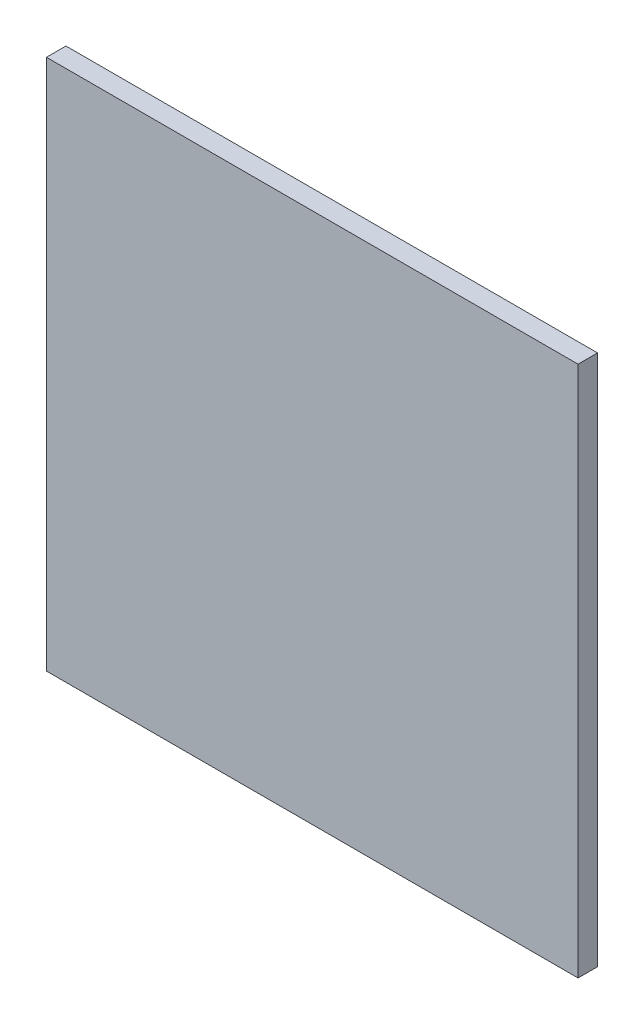
ISO-10303-21;
HEADER;
FILE_DESCRIPTION(('STEP AP214'),'2;1');
FILE_NAME('part.step','',(''),(''),'','','');
FILE_SCHEMA(('AUTOMOTIVE_DESIGN { 1 0 10303 214 1 1 1 1 }'));
ENDSEC;
DATA;
#1=APPLICATION_CONTEXT('core data for automotive mechanical design processes');
#2=APPLICATION_PROTOCOL_DEFINITION('international standard','automotive_design',2000,#1);
#3=PRODUCT_CONTEXT('',#1,'mechanical');
#4=PRODUCT('Part','Part','',(#3));
#5=PRODUCT_RELATED_PRODUCT_CATEGORY('part','',(#4));
#6=PRODUCT_DEFINITION_FORMATION('','',#4);
#7=PRODUCT_DEFINITION_CONTEXT('part definition',#1,'design');
#8=PRODUCT_DEFINITION('design','',#6,#7);
#9=PRODUCT_DEFINITION_SHAPE('','',#8);
#10=(LENGTH_UNIT() NAMED_UNIT(*) SI_UNIT(.MILLI.,.METRE.));
#11=(NAMED_UNIT(*) PLANE_ANGLE_UNIT() SI_UNIT($,.RADIAN.));
#12=(NAMED_UNIT(*) SI_UNIT($,.STERADIAN.) SOLID_ANGLE_UNIT());
#13=UNCERTAINTY_MEASURE_WITH_UNIT(LENGTH_MEASURE(1.E-05),#10,'distance_accuracy_value','');
#14=(GEOMETRIC_REPRESENTATION_CONTEXT(3) GLOBAL_UNCERTAINTY_ASSIGNED_CONTEXT((#13)) GLOBAL_UNIT_ASSIGNED_CONTEXT((#10,
#11,#12)) REPRESENTATION_CONTEXT('',''));
#15=CARTESIAN_POINT('',(0.,0.,0.));
#16=DIRECTION('',(0.,0.,1.));
#17=DIRECTION('',(1.,0.,0.));
#18=AXIS2_PLACEMENT_3D('',#15,#16,#17);
#19=CARTESIAN_POINT('',(15.,-15.,1.1));
#20=DIRECTION('',(-1.,0.,0.));
#21=DIRECTION('',(0.,0.,1.));
#22=AXIS2_PLACEMENT_3D('',#19,#20,#21);
#23=PLANE('',#22);
#24=DIRECTION('',(0.,1.,0.));
#25=VECTOR('',#24,1.);
#26=CARTESIAN_POINT('',(15.,-15.,0.));
#27=LINE('',#26,#25);
#28=CARTESIAN_POINT('',(15.,-15.,0.));
#29=VERTEX_POINT('',#28);
#30=CARTESIAN_POINT('',(15.,15.,0.));
#31=VERTEX_POINT('',#30);
#32=EDGE_CURVE('E108',#29,#31,#27,.T.);
#33=ORIENTED_EDGE('',*,*,#32,.T.);
#34=DIRECTION('',(0.,0.,-1.));
#35=VECTOR('',#34,1.);
#36=CARTESIAN_POINT('',(15.,15.,1.1));
#37=LINE('',#36,#35);
#38=CARTESIAN_POINT('',(15.,15.,1.1));
#39=VERTEX_POINT('',#38);
#40=EDGE_CURVE('E11',#39,#31,#37,.T.);
#41=ORIENTED_EDGE('',*,*,#40,.F.);
#42=DIRECTION('',(0.,1.,0.));
#43=VECTOR('',#42,1.);
#44=CARTESIAN_POINT('',(15.,-15.,1.1));
#45=LINE('',#44,#43);
#46=CARTESIAN_POINT('',(15.,-15.,1.1));
#47=VERTEX_POINT('',#46);
#48=EDGE_CURVE('E91',#47,#39,#45,.T.);
#49=ORIENTED_EDGE('',*,*,#48,.F.);
#50=DIRECTION('',(0.,0.,-1.));
#51=VECTOR('',#50,1.);
#52=CARTESIAN_POINT('',(15.,-15.,1.1));
#53=LINE('',#52,#51);
#54=EDGE_CURVE('E104',#47,#29,#53,.T.);
#55=ORIENTED_EDGE('',*,*,#54,.T.);
#56=EDGE_LOOP('',(#33,#41,#49,#55));
#57=FACE_BOUND('',#56,.T.);
#58=ADVANCED_FACE('F39',(#57),#23,.F.);
#59=CARTESIAN_POINT('',(-15.,15.,1.1));
#60=DIRECTION('',(0.,-1.,0.));
#61=DIRECTION('',(0.,0.,-1.));
#62=AXIS2_PLACEMENT_3D('',#59,#60,#61);
#63=PLANE('',#62);
#64=DIRECTION('',(-1.,0.,0.));
#65=VECTOR('',#64,1.);
#66=CARTESIAN_POINT('',(-15.,15.,0.));
#67=LINE('',#66,#65);
#68=CARTESIAN_POINT('',(-15.,15.,0.));
#69=VERTEX_POINT('',#68);
#70=EDGE_CURVE('E96',#31,#69,#67,.T.);
#71=ORIENTED_EDGE('',*,*,#70,.T.);
#72=DIRECTION('',(0.,0.,-1.));
#73=VECTOR('',#72,1.);
#74=CARTESIAN_POINT('',(-15.,15.,1.1));
#75=LINE('',#74,#73);
#76=CARTESIAN_POINT('',(-15.,15.,1.1));
#77=VERTEX_POINT('',#76);
#78=EDGE_CURVE('E48',#77,#69,#75,.T.);
#79=ORIENTED_EDGE('',*,*,#78,.F.);
#80=DIRECTION('',(-1.,0.,0.));
#81=VECTOR('',#80,1.);
#82=CARTESIAN_POINT('',(-15.,15.,1.1));
#83=LINE('',#82,#81);
#84=EDGE_CURVE('E86',#39,#77,#83,.T.);
#85=ORIENTED_EDGE('',*,*,#84,.F.);
#86=ORIENTED_EDGE('',*,*,#40,.T.);
#87=EDGE_LOOP('',(#71,#79,#85,#86));
#88=FACE_BOUND('',#87,.T.);
#89=ADVANCED_FACE('F95',(#88),#63,.F.);
#90=CARTESIAN_POINT('',(-15.,-15.,1.1));
#91=DIRECTION('',(1.,0.,0.));
#92=DIRECTION('',(0.,0.,-1.));
#93=AXIS2_PLACEMENT_3D('',#90,#91,#92);
#94=PLANE('',#93);
#95=DIRECTION('',(0.,-1.,0.));
#96=VECTOR('',#95,1.);
#97=CARTESIAN_POINT('',(-15.,-15.,0.));
#98=LINE('',#97,#96);
#99=CARTESIAN_POINT('',(-15.,-15.,0.));
#100=VERTEX_POINT('',#99);
#101=EDGE_CURVE('E73',#69,#100,#98,.T.);
#102=ORIENTED_EDGE('',*,*,#101,.T.);
#103=DIRECTION('',(0.,0.,-1.));
#104=VECTOR('',#103,1.);
#105=CARTESIAN_POINT('',(-15.,-15.,1.1));
#106=LINE('',#105,#104);
#107=CARTESIAN_POINT('',(-15.,-15.,1.1));
#108=VERTEX_POINT('',#107);
#109=EDGE_CURVE('E98',#108,#100,#106,.T.);
#110=ORIENTED_EDGE('',*,*,#109,.F.);
#111=DIRECTION('',(0.,-1.,0.));
#112=VECTOR('',#111,1.);
#113=CARTESIAN_POINT('',(-15.,-15.,1.1));
#114=LINE('',#113,#112);
#115=EDGE_CURVE('E89',#77,#108,#114,.T.);
#116=ORIENTED_EDGE('',*,*,#115,.F.);
#117=ORIENTED_EDGE('',*,*,#78,.T.);
#118=EDGE_LOOP('',(#102,#110,#116,#117));
#119=FACE_BOUND('',#118,.T.);
#120=ADVANCED_FACE('F99',(#119),#94,.F.);
#121=CARTESIAN_POINT('',(-15.,-15.,1.1));
#122=DIRECTION('',(0.,1.,0.));
#123=DIRECTION('',(0.,0.,1.));
#124=AXIS2_PLACEMENT_3D('',#121,#122,#123);
#125=PLANE('',#124);
#126=DIRECTION('',(1.,0.,0.));
#127=VECTOR('',#126,1.);
#128=CARTESIAN_POINT('',(-15.,-15.,0.));
#129=LINE('',#128,#127);
#130=EDGE_CURVE('E79',#100,#29,#129,.T.);
#131=ORIENTED_EDGE('',*,*,#130,.T.);
#132=ORIENTED_EDGE('',*,*,#54,.F.);
#133=DIRECTION('',(1.,0.,0.));
#134=VECTOR('',#133,1.);
#135=CARTESIAN_POINT('',(-15.,-15.,1.1));
#136=LINE('',#135,#134);
#137=EDGE_CURVE('E56',#108,#47,#136,.T.);
#138=ORIENTED_EDGE('',*,*,#137,.F.);
#139=ORIENTED_EDGE('',*,*,#109,.T.);
#140=EDGE_LOOP('',(#131,#132,#138,#139));
#141=FACE_BOUND('',#140,.T.);
#142=ADVANCED_FACE('F120',(#141),#125,.F.);
#143=CARTESIAN_POINT('',(0.,0.,1.1));
#144=DIRECTION('',(0.,0.,-1.));
#145=DIRECTION('',(-1.,0.,0.));
#146=AXIS2_PLACEMENT_3D('',#143,#144,#145);
#147=PLANE('',#146);
#148=ORIENTED_EDGE('',*,*,#48,.T.);
#149=ORIENTED_EDGE('',*,*,#84,.T.);
#150=ORIENTED_EDGE('',*,*,#115,.T.);
#151=ORIENTED_EDGE('',*,*,#137,.T.);
#152=EDGE_LOOP('',(#148,#149,#150,#151));
#153=FACE_BOUND('',#152,.T.);
#154=ADVANCED_FACE('F87',(#153),#147,.F.);
#155=CARTESIAN_POINT('',(0.,0.,0.));
#156=DIRECTION('',(0.,0.,-1.));
#157=DIRECTION('',(-1.,0.,0.));
#158=AXIS2_PLACEMENT_3D('',#155,#156,#157);
#159=PLANE('',#158);
#160=ORIENTED_EDGE('',*,*,#32,.F.);
#161=ORIENTED_EDGE('',*,*,#130,.F.);
#162=ORIENTED_EDGE('',*,*,#101,.F.);
#163=ORIENTED_EDGE('',*,*,#70,.F.);
#164=EDGE_LOOP('',(#160,#161,#162,#163));
#165=FACE_BOUND('',#164,.T.);
#166=ADVANCED_FACE('F123',(#165),#159,.T.);
#167=CLOSED_SHELL('',(#58,#89,#120,#142,#154,#166));
#168=MANIFOLD_SOLID_BREP('B2',#167);
#169=ADVANCED_BREP_SHAPE_REPRESENTATION('',(#18,#168),#14);
#170=SHAPE_DEFINITION_REPRESENTATION(#9,#169);
ENDSEC;
END-ISO-10303-21;
